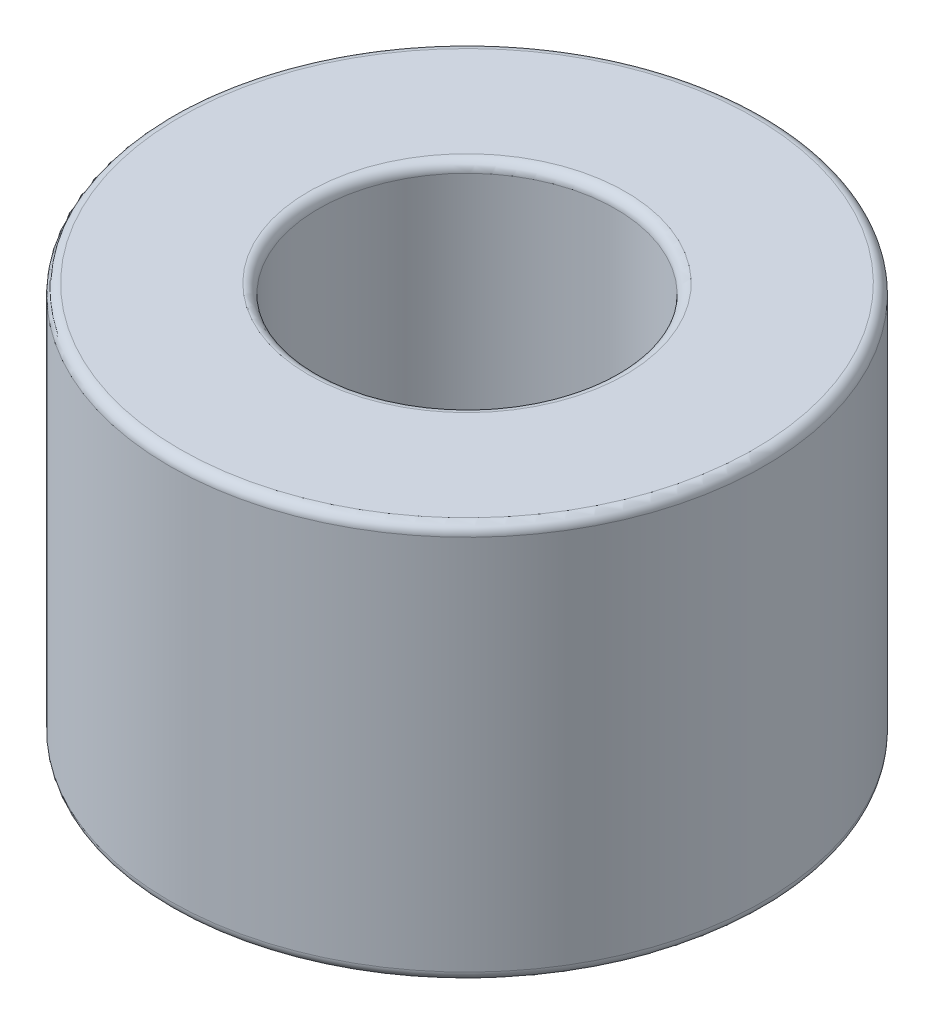
ISO-10303-21;
HEADER;
FILE_DESCRIPTION(('STEP AP214'),'2;1');
FILE_NAME('part.step','',(''),(''),'','','');
FILE_SCHEMA(('AUTOMOTIVE_DESIGN { 1 0 10303 214 1 1 1 1 }'));
ENDSEC;
DATA;
#1=APPLICATION_CONTEXT('core data for automotive mechanical design processes');
#2=APPLICATION_PROTOCOL_DEFINITION('international standard','automotive_design',2000,#1);
#3=PRODUCT_CONTEXT('',#1,'mechanical');
#4=PRODUCT('Part','Part','',(#3));
#5=PRODUCT_RELATED_PRODUCT_CATEGORY('part','',(#4));
#6=PRODUCT_DEFINITION_FORMATION('','',#4);
#7=PRODUCT_DEFINITION_CONTEXT('part definition',#1,'design');
#8=PRODUCT_DEFINITION('design','',#6,#7);
#9=PRODUCT_DEFINITION_SHAPE('','',#8);
#10=(LENGTH_UNIT() NAMED_UNIT(*) SI_UNIT(.MILLI.,.METRE.));
#11=(NAMED_UNIT(*) PLANE_ANGLE_UNIT() SI_UNIT($,.RADIAN.));
#12=(NAMED_UNIT(*) SI_UNIT($,.STERADIAN.) SOLID_ANGLE_UNIT());
#13=UNCERTAINTY_MEASURE_WITH_UNIT(LENGTH_MEASURE(1.E-05),#10,'distance_accuracy_value','');
#14=(GEOMETRIC_REPRESENTATION_CONTEXT(3) GLOBAL_UNCERTAINTY_ASSIGNED_CONTEXT((#13)) GLOBAL_UNIT_ASSIGNED_CONTEXT((#10,
#11,#12)) REPRESENTATION_CONTEXT('',''));
#15=CARTESIAN_POINT('',(0.,0.,0.));
#16=DIRECTION('',(0.,0.,1.));
#17=DIRECTION('',(1.,0.,0.));
#18=AXIS2_PLACEMENT_3D('',#15,#16,#17);
#19=CARTESIAN_POINT('',(0.,8.,0.));
#20=DIRECTION('',(0.,1.,0.));
#21=DIRECTION('',(0.,0.,1.));
#22=AXIS2_PLACEMENT_3D('',#19,#20,#21);
#23=PLANE('',#22);
#24=CARTESIAN_POINT('',(0.,8.,0.));
#25=DIRECTION('',(0.,1.,0.));
#26=DIRECTION('',(0.,0.,1.));
#27=AXIS2_PLACEMENT_3D('',#24,#25,#26);
#28=CIRCLE('',#27,3.2);
#29=CARTESIAN_POINT('',(0.,8.,3.2));
#30=VERTEX_POINT('',#29);
#31=EDGE_CURVE('E51',#30,#30,#28,.F.);
#32=ORIENTED_EDGE('',*,*,#31,.T.);
#33=EDGE_LOOP('',(#32));
#34=FACE_BOUND('',#33,.T.);
#35=CARTESIAN_POINT('',(0.,8.,0.));
#36=DIRECTION('',(0.,1.,0.));
#37=DIRECTION('',(0.,0.,1.));
#38=AXIS2_PLACEMENT_3D('',#35,#36,#37);
#39=CIRCLE('',#38,5.8);
#40=CARTESIAN_POINT('',(0.,8.,5.8));
#41=VERTEX_POINT('',#40);
#42=EDGE_CURVE('E54',#41,#41,#39,.T.);
#43=ORIENTED_EDGE('',*,*,#42,.T.);
#44=EDGE_LOOP('',(#43));
#45=FACE_BOUND('',#44,.T.);
#46=ADVANCED_FACE('F31',(#34,#45),#23,.T.);
#47=CARTESIAN_POINT('',(0.,0.,0.));
#48=DIRECTION('',(0.,1.,0.));
#49=DIRECTION('',(0.,0.,1.));
#50=AXIS2_PLACEMENT_3D('',#47,#48,#49);
#51=PLANE('',#50);
#52=CARTESIAN_POINT('',(0.,0.,0.));
#53=DIRECTION('',(0.,1.,0.));
#54=DIRECTION('',(0.,0.,1.));
#55=AXIS2_PLACEMENT_3D('',#52,#53,#54);
#56=CIRCLE('',#55,3.2);
#57=CARTESIAN_POINT('',(0.,0.,3.2));
#58=VERTEX_POINT('',#57);
#59=EDGE_CURVE('E42',#58,#58,#56,.T.);
#60=ORIENTED_EDGE('',*,*,#59,.T.);
#61=EDGE_LOOP('',(#60));
#62=FACE_BOUND('',#61,.T.);
#63=CARTESIAN_POINT('',(0.,0.,0.));
#64=DIRECTION('',(0.,1.,0.));
#65=DIRECTION('',(0.,0.,1.));
#66=AXIS2_PLACEMENT_3D('',#63,#64,#65);
#67=CIRCLE('',#66,5.8);
#68=CARTESIAN_POINT('',(0.,0.,5.8));
#69=VERTEX_POINT('',#68);
#70=EDGE_CURVE('E46',#69,#69,#67,.F.);
#71=ORIENTED_EDGE('',*,*,#70,.T.);
#72=EDGE_LOOP('',(#71));
#73=FACE_BOUND('',#72,.T.);
#74=ADVANCED_FACE('F74',(#62,#73),#51,.F.);
#75=CARTESIAN_POINT('',(0.,8.,0.));
#76=DIRECTION('',(0.,-1.,0.));
#77=DIRECTION('',(0.,0.,-1.));
#78=AXIS2_PLACEMENT_3D('',#75,#76,#77);
#79=CYLINDRICAL_SURFACE('',#78,6.);
#80=CARTESIAN_POINT('',(0.,0.2,0.));
#81=DIRECTION('',(0.,1.,0.));
#82=DIRECTION('',(0.,0.,1.));
#83=AXIS2_PLACEMENT_3D('',#80,#81,#82);
#84=CIRCLE('',#83,6.);
#85=CARTESIAN_POINT('',(0.,0.2,6.));
#86=VERTEX_POINT('',#85);
#87=EDGE_CURVE('E10',#86,#86,#84,.T.);
#88=ORIENTED_EDGE('',*,*,#87,.T.);
#89=EDGE_LOOP('',(#88));
#90=FACE_BOUND('',#89,.T.);
#91=CARTESIAN_POINT('',(0.,7.8,0.));
#92=DIRECTION('',(0.,1.,0.));
#93=DIRECTION('',(0.,0.,1.));
#94=AXIS2_PLACEMENT_3D('',#91,#92,#93);
#95=CIRCLE('',#94,6.);
#96=CARTESIAN_POINT('',(0.,7.8,6.));
#97=VERTEX_POINT('',#96);
#98=EDGE_CURVE('E38',#97,#97,#95,.F.);
#99=ORIENTED_EDGE('',*,*,#98,.T.);
#100=EDGE_LOOP('',(#99));
#101=FACE_BOUND('',#100,.T.);
#102=ADVANCED_FACE('F77',(#90,#101),#79,.T.);
#103=CARTESIAN_POINT('',(0.,8.,0.));
#104=DIRECTION('',(0.,-1.,0.));
#105=DIRECTION('',(0.,0.,-1.));
#106=AXIS2_PLACEMENT_3D('',#103,#104,#105);
#107=CYLINDRICAL_SURFACE('',#106,3.);
#108=CARTESIAN_POINT('',(0.,7.8,0.));
#109=DIRECTION('',(0.,1.,0.));
#110=DIRECTION('',(0.,0.,1.));
#111=AXIS2_PLACEMENT_3D('',#108,#109,#110);
#112=CIRCLE('',#111,3.);
#113=CARTESIAN_POINT('',(0.,7.8,3.));
#114=VERTEX_POINT('',#113);
#115=EDGE_CURVE('E57',#114,#114,#112,.T.);
#116=ORIENTED_EDGE('',*,*,#115,.T.);
#117=EDGE_LOOP('',(#116));
#118=FACE_BOUND('',#117,.T.);
#119=CARTESIAN_POINT('',(0.,0.2,0.));
#120=DIRECTION('',(0.,1.,0.));
#121=DIRECTION('',(0.,0.,1.));
#122=AXIS2_PLACEMENT_3D('',#119,#120,#121);
#123=CIRCLE('',#122,3.);
#124=CARTESIAN_POINT('',(0.,0.2,3.));
#125=VERTEX_POINT('',#124);
#126=EDGE_CURVE('E60',#125,#125,#123,.F.);
#127=ORIENTED_EDGE('',*,*,#126,.T.);
#128=EDGE_LOOP('',(#127));
#129=FACE_BOUND('',#128,.T.);
#130=ADVANCED_FACE('F64',(#118,#129),#107,.F.);
#131=CARTESIAN_POINT('',(0.,7.8,0.));
#132=DIRECTION('',(0.,1.,0.));
#133=DIRECTION('',(0.,0.,1.));
#134=AXIS2_PLACEMENT_3D('',#131,#132,#133);
#135=TOROIDAL_SURFACE('',#134,3.2,0.2);
#136=ORIENTED_EDGE('',*,*,#31,.F.);
#137=EDGE_LOOP('',(#136));
#138=FACE_BOUND('',#137,.T.);
#139=ORIENTED_EDGE('',*,*,#115,.F.);
#140=EDGE_LOOP('',(#139));
#141=FACE_BOUND('',#140,.T.);
#142=ADVANCED_FACE('F70',(#138,#141),#135,.T.);
#143=CARTESIAN_POINT('',(0.,0.2,0.));
#144=DIRECTION('',(0.,1.,0.));
#145=DIRECTION('',(0.,0.,1.));
#146=AXIS2_PLACEMENT_3D('',#143,#144,#145);
#147=TOROIDAL_SURFACE('',#146,3.2,0.2);
#148=ORIENTED_EDGE('',*,*,#126,.F.);
#149=EDGE_LOOP('',(#148));
#150=FACE_BOUND('',#149,.T.);
#151=ORIENTED_EDGE('',*,*,#59,.F.);
#152=EDGE_LOOP('',(#151));
#153=FACE_BOUND('',#152,.T.);
#154=ADVANCED_FACE('F66',(#150,#153),#147,.T.);
#155=CARTESIAN_POINT('',(0.,0.2,0.));
#156=DIRECTION('',(0.,1.,0.));
#157=DIRECTION('',(0.,0.,1.));
#158=AXIS2_PLACEMENT_3D('',#155,#156,#157);
#159=TOROIDAL_SURFACE('',#158,5.8,0.2);
#160=ORIENTED_EDGE('',*,*,#70,.F.);
#161=EDGE_LOOP('',(#160));
#162=FACE_BOUND('',#161,.T.);
#163=ORIENTED_EDGE('',*,*,#87,.F.);
#164=EDGE_LOOP('',(#163));
#165=FACE_BOUND('',#164,.T.);
#166=ADVANCED_FACE('F69',(#162,#165),#159,.T.);
#167=CARTESIAN_POINT('',(0.,7.8,0.));
#168=DIRECTION('',(0.,1.,0.));
#169=DIRECTION('',(0.,0.,1.));
#170=AXIS2_PLACEMENT_3D('',#167,#168,#169);
#171=TOROIDAL_SURFACE('',#170,5.8,0.2);
#172=ORIENTED_EDGE('',*,*,#98,.F.);
#173=EDGE_LOOP('',(#172));
#174=FACE_BOUND('',#173,.T.);
#175=ORIENTED_EDGE('',*,*,#42,.F.);
#176=EDGE_LOOP('',(#175));
#177=FACE_BOUND('',#176,.T.);
#178=ADVANCED_FACE('F33',(#174,#177),#171,.T.);
#179=CLOSED_SHELL('',(#46,#74,#102,#130,#142,#154,#166,#178));
#180=MANIFOLD_SOLID_BREP('B2',#179);
#181=ADVANCED_BREP_SHAPE_REPRESENTATION('',(#18,#180),#14);
#182=SHAPE_DEFINITION_REPRESENTATION(#9,#181);
ENDSEC;
END-ISO-10303-21;
